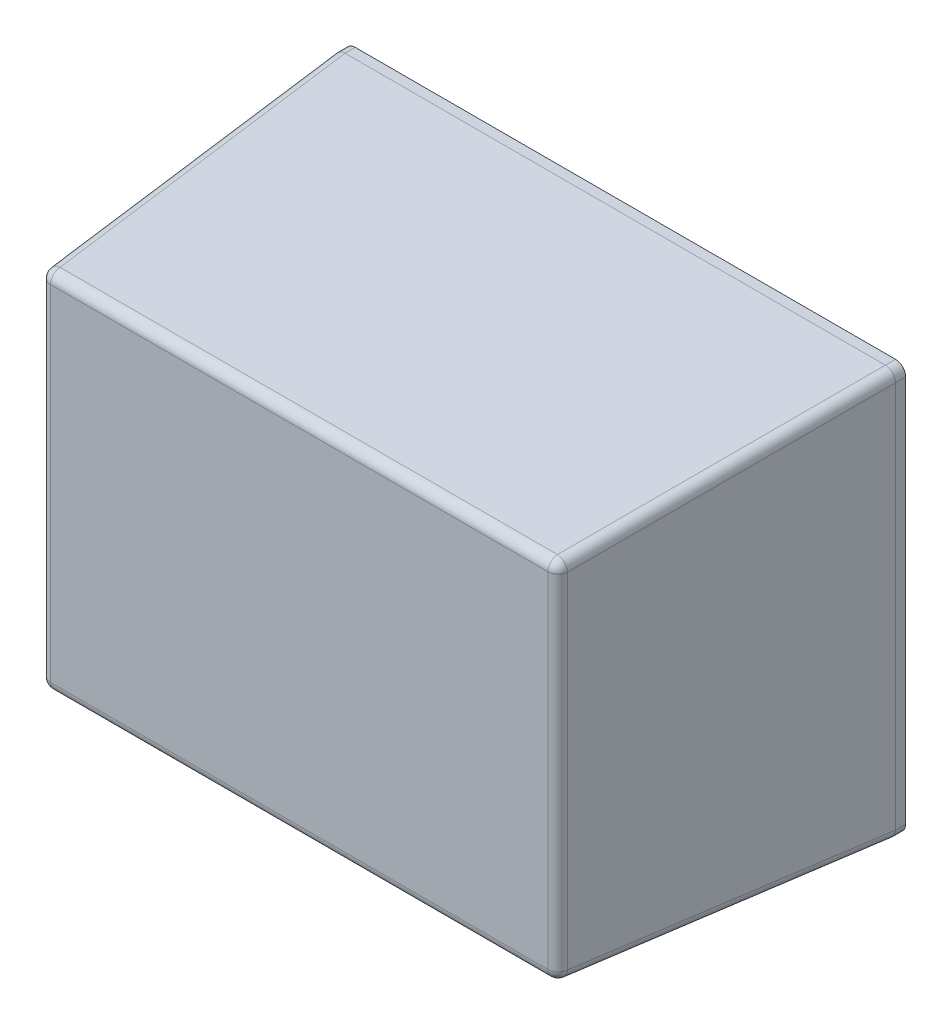
ISO-10303-21;
HEADER;
FILE_DESCRIPTION(('STEP AP214'),'2;1');
FILE_NAME('part.step','',(''),(''),'','','');
FILE_SCHEMA(('AUTOMOTIVE_DESIGN { 1 0 10303 214 1 1 1 1 }'));
ENDSEC;
DATA;
#1=APPLICATION_CONTEXT('core data for automotive mechanical design processes');
#2=APPLICATION_PROTOCOL_DEFINITION('international standard','automotive_design',2000,#1);
#3=PRODUCT_CONTEXT('',#1,'mechanical');
#4=PRODUCT('Part','Part','',(#3));
#5=PRODUCT_RELATED_PRODUCT_CATEGORY('part','',(#4));
#6=PRODUCT_DEFINITION_FORMATION('','',#4);
#7=PRODUCT_DEFINITION_CONTEXT('part definition',#1,'design');
#8=PRODUCT_DEFINITION('design','',#6,#7);
#9=PRODUCT_DEFINITION_SHAPE('','',#8);
#10=(LENGTH_UNIT() NAMED_UNIT(*) SI_UNIT(.MILLI.,.METRE.));
#11=(NAMED_UNIT(*) PLANE_ANGLE_UNIT() SI_UNIT($,.RADIAN.));
#12=(NAMED_UNIT(*) SI_UNIT($,.STERADIAN.) SOLID_ANGLE_UNIT());
#13=UNCERTAINTY_MEASURE_WITH_UNIT(LENGTH_MEASURE(1.E-05),#10,'distance_accuracy_value','');
#14=(GEOMETRIC_REPRESENTATION_CONTEXT(3) GLOBAL_UNCERTAINTY_ASSIGNED_CONTEXT((#13)) GLOBAL_UNIT_ASSIGNED_CONTEXT((#10,
#11,#12)) REPRESENTATION_CONTEXT('',''));
#15=CARTESIAN_POINT('',(0.,0.,0.));
#16=DIRECTION('',(0.,0.,1.));
#17=DIRECTION('',(1.,0.,0.));
#18=AXIS2_PLACEMENT_3D('',#15,#16,#17);
#19=CARTESIAN_POINT('',(-0.55,-0.380048718995,0.28));
#20=DIRECTION('',(-1.,0.,0.));
#21=DIRECTION('',(0.,0.,1.));
#22=AXIS2_PLACEMENT_3D('',#19,#20,#21);
#23=PLANE('',#22);
#24=DIRECTION('',(0.,-1.,0.));
#25=VECTOR('',#24,1.);
#26=CARTESIAN_POINT('',(-0.55,-0.347785001125,0.28));
#27=LINE('',#26,#25);
#28=CARTESIAN_POINT('',(-0.55,0.380048718995,0.28));
#29=VERTEX_POINT('',#28);
#30=CARTESIAN_POINT('',(-0.55,-0.380048718995,0.28));
#31=VERTEX_POINT('',#30);
#32=EDGE_CURVE('E41',#29,#31,#27,.T.);
#33=ORIENTED_EDGE('',*,*,#32,.F.);
#34=DIRECTION('',(0.,0.,-1.));
#35=VECTOR('',#34,1.);
#36=CARTESIAN_POINT('',(-0.55,0.380048718995,0.28));
#37=LINE('',#36,#35);
#38=CARTESIAN_POINT('',(-0.55,0.380048718995,0.26));
#39=VERTEX_POINT('',#38);
#40=EDGE_CURVE('E11',#29,#39,#37,.T.);
#41=ORIENTED_EDGE('',*,*,#40,.T.);
#42=DIRECTION('',(0.,1.,0.));
#43=VECTOR('',#42,1.);
#44=CARTESIAN_POINT('',(-0.55,0.380048718995,0.26));
#45=LINE('',#44,#43);
#46=CARTESIAN_POINT('',(-0.55,-0.380048718995,0.26));
#47=VERTEX_POINT('',#46);
#48=EDGE_CURVE('E262',#47,#39,#45,.T.);
#49=ORIENTED_EDGE('',*,*,#48,.F.);
#50=DIRECTION('',(0.,0.,-1.));
#51=VECTOR('',#50,1.);
#52=CARTESIAN_POINT('',(-0.55,-0.380048718995,0.28));
#53=LINE('',#52,#51);
#54=EDGE_CURVE('E216',#31,#47,#53,.T.);
#55=ORIENTED_EDGE('',*,*,#54,.F.);
#56=EDGE_LOOP('',(#33,#41,#49,#55));
#57=FACE_BOUND('',#56,.T.);
#58=ADVANCED_FACE('F17',(#57),#23,.T.);
#59=CARTESIAN_POINT('',(-0.530048718995,-0.4,0.28));
#60=CARTESIAN_POINT('',(-0.55,-0.4,0.28));
#61=CARTESIAN_POINT('',(-0.55,-0.380048718995,0.28));
#62=CARTESIAN_POINT('',(-0.530048718995,-0.4,0.26));
#63=CARTESIAN_POINT('',(-0.55,-0.4,0.26));
#64=CARTESIAN_POINT('',(-0.55,-0.380048718995,0.26));
#65=(BOUNDED_SURFACE() B_SPLINE_SURFACE(1,2,((#59,#60,#61),(#62,#63,#64)),.UNSPECIFIED.,.F.,.F.,
.F.) B_SPLINE_SURFACE_WITH_KNOTS((2,2),(3,3),(0.,0.995145815784),(2.358627482608,
3.924557824571),.UNSPECIFIED.) GEOMETRIC_REPRESENTATION_ITEM() RATIONAL_B_SPLINE_SURFACE(((1.,
0.708825072084,1.),(1.,0.708825072084,1.))) REPRESENTATION_ITEM('') SURFACE());
#66=CARTESIAN_POINT('',(-0.529951162038,-0.379951162038,0.28));
#67=DIRECTION('',(0.,0.,-1.));
#68=DIRECTION('',(-0.707106781186548,-0.707106781186548,0.));
#69=AXIS2_PLACEMENT_3D('',#66,#67,#68);
#70=ELLIPSE('',#69,0.02009755724517,0.02);
#71=CARTESIAN_POINT('',(-0.530048718995,-0.4,0.28));
#72=VERTEX_POINT('',#71);
#73=EDGE_CURVE('E28',#72,#31,#70,.T.);
#74=CARTESIAN_POINT('',(-0.529951162038,-0.379951162038,0.26));
#75=DIRECTION('',(0.,0.,-1.));
#76=DIRECTION('',(0.707106781186548,0.707106781186548,0.));
#77=AXIS2_PLACEMENT_3D('',#74,#75,#76);
#78=ELLIPSE('',#77,0.02009755724517,0.02);
#79=CARTESIAN_POINT('',(-0.530048718995,-0.4,0.26));
#80=VERTEX_POINT('',#79);
#81=EDGE_CURVE('E259',#80,#47,#78,.T.);
#82=DIRECTION('',(0.,0.,-1.));
#83=VECTOR('',#82,1.);
#84=CARTESIAN_POINT('',(-0.530048718995,-0.4,0.28));
#85=LINE('',#84,#83);
#86=EDGE_CURVE('E212',#72,#80,#85,.T.);
#87=ORIENTED_EDGE('',*,*,#73,.T.);
#88=ORIENTED_EDGE('',*,*,#54,.T.);
#89=ORIENTED_EDGE('',*,*,#81,.F.);
#90=ORIENTED_EDGE('',*,*,#86,.F.);
#91=EDGE_LOOP('',(#87,#88,#89,#90));
#92=FACE_BOUND('',#91,.T.);
#93=ADVANCED_FACE('F380',(#92),#65,.F.);
#94=CARTESIAN_POINT('',(0.530048718995,-0.4,0.28));
#95=DIRECTION('',(0.,-1.,0.));
#96=DIRECTION('',(0.,0.,-1.));
#97=AXIS2_PLACEMENT_3D('',#94,#95,#96);
#98=PLANE('',#97);
#99=DIRECTION('',(1.,0.,0.));
#100=VECTOR('',#99,1.);
#101=CARTESIAN_POINT('',(-0.4,-0.4,0.28));
#102=LINE('',#101,#100);
#103=CARTESIAN_POINT('',(0.530048718995,-0.4,0.28));
#104=VERTEX_POINT('',#103);
#105=EDGE_CURVE('E179',#72,#104,#102,.T.);
#106=ORIENTED_EDGE('',*,*,#105,.F.);
#107=ORIENTED_EDGE('',*,*,#86,.T.);
#108=DIRECTION('',(-1.,0.,0.));
#109=VECTOR('',#108,1.);
#110=CARTESIAN_POINT('',(-0.530048718995,-0.4,0.26));
#111=LINE('',#110,#109);
#112=CARTESIAN_POINT('',(0.530048718995,-0.4,0.26));
#113=VERTEX_POINT('',#112);
#114=EDGE_CURVE('E203',#113,#80,#111,.T.);
#115=ORIENTED_EDGE('',*,*,#114,.F.);
#116=DIRECTION('',(0.,0.,-1.));
#117=VECTOR('',#116,1.);
#118=CARTESIAN_POINT('',(0.530048718995,-0.4,0.28));
#119=LINE('',#118,#117);
#120=EDGE_CURVE('E300',#104,#113,#119,.T.);
#121=ORIENTED_EDGE('',*,*,#120,.F.);
#122=EDGE_LOOP('',(#106,#107,#115,#121));
#123=FACE_BOUND('',#122,.T.);
#124=ADVANCED_FACE('F385',(#123),#98,.T.);
#125=CARTESIAN_POINT('',(0.55,-0.380048718995,0.28));
#126=CARTESIAN_POINT('',(0.55,-0.4,0.28));
#127=CARTESIAN_POINT('',(0.530048718995,-0.4,0.28));
#128=CARTESIAN_POINT('',(0.55,-0.380048718995,0.26));
#129=CARTESIAN_POINT('',(0.55,-0.4,0.26));
#130=CARTESIAN_POINT('',(0.530048718995,-0.4,0.26));
#131=(BOUNDED_SURFACE() B_SPLINE_SURFACE(1,2,((#125,#126,#127),(#128,#129,#130)),.UNSPECIFIED.,
.F.,.F.,.F.) B_SPLINE_SURFACE_WITH_KNOTS((2,2),(3,3),(0.,0.995145815784),(2.358627482608,
3.924557824571),.UNSPECIFIED.) GEOMETRIC_REPRESENTATION_ITEM() RATIONAL_B_SPLINE_SURFACE(((1.,
0.708825072084,1.),(1.,0.708825072084,1.))) REPRESENTATION_ITEM('') SURFACE());
#132=CARTESIAN_POINT('',(0.529951162038,-0.379951162038,0.28));
#133=DIRECTION('',(0.,0.,-1.));
#134=DIRECTION('',(0.707106781186548,-0.707106781186548,0.));
#135=AXIS2_PLACEMENT_3D('',#132,#133,#134);
#136=ELLIPSE('',#135,0.02009755724517,0.02);
#137=CARTESIAN_POINT('',(0.55,-0.380048718995,0.28));
#138=VERTEX_POINT('',#137);
#139=EDGE_CURVE('E217',#138,#104,#136,.T.);
#140=CARTESIAN_POINT('',(0.529951162038,-0.379951162038,0.26));
#141=DIRECTION('',(0.,0.,-1.));
#142=DIRECTION('',(-0.707106781186548,0.707106781186548,0.));
#143=AXIS2_PLACEMENT_3D('',#140,#141,#142);
#144=ELLIPSE('',#143,0.02009755724517,0.02);
#145=CARTESIAN_POINT('',(0.55,-0.380048718995,0.26));
#146=VERTEX_POINT('',#145);
#147=EDGE_CURVE('E199',#146,#113,#144,.T.);
#148=DIRECTION('',(0.,0.,-1.));
#149=VECTOR('',#148,1.);
#150=CARTESIAN_POINT('',(0.55,-0.380048718995,0.28));
#151=LINE('',#150,#149);
#152=EDGE_CURVE('E437',#138,#146,#151,.T.);
#153=ORIENTED_EDGE('',*,*,#139,.T.);
#154=ORIENTED_EDGE('',*,*,#120,.T.);
#155=ORIENTED_EDGE('',*,*,#147,.F.);
#156=ORIENTED_EDGE('',*,*,#152,.F.);
#157=EDGE_LOOP('',(#153,#154,#155,#156));
#158=FACE_BOUND('',#157,.T.);
#159=ADVANCED_FACE('F410',(#158),#131,.F.);
#160=CARTESIAN_POINT('',(0.55,0.380048718995,0.28));
#161=DIRECTION('',(1.,0.,0.));
#162=DIRECTION('',(0.,1.,0.));
#163=AXIS2_PLACEMENT_3D('',#160,#161,#162);
#164=PLANE('',#163);
#165=DIRECTION('',(0.,1.,0.));
#166=VECTOR('',#165,1.);
#167=CARTESIAN_POINT('',(0.55,0.347785001125,0.28));
#168=LINE('',#167,#166);
#169=CARTESIAN_POINT('',(0.55,0.380048718995,0.28));
#170=VERTEX_POINT('',#169);
#171=EDGE_CURVE('E107',#138,#170,#168,.T.);
#172=ORIENTED_EDGE('',*,*,#171,.F.);
#173=ORIENTED_EDGE('',*,*,#152,.T.);
#174=DIRECTION('',(0.,-1.,0.));
#175=VECTOR('',#174,1.);
#176=CARTESIAN_POINT('',(0.55,-0.380048718995,0.26));
#177=LINE('',#176,#175);
#178=CARTESIAN_POINT('',(0.55,0.380048718995,0.26));
#179=VERTEX_POINT('',#178);
#180=EDGE_CURVE('E119',#179,#146,#177,.T.);
#181=ORIENTED_EDGE('',*,*,#180,.F.);
#182=DIRECTION('',(0.,0.,-1.));
#183=VECTOR('',#182,1.);
#184=CARTESIAN_POINT('',(0.55,0.380048718995,0.28));
#185=LINE('',#184,#183);
#186=EDGE_CURVE('E208',#170,#179,#185,.T.);
#187=ORIENTED_EDGE('',*,*,#186,.F.);
#188=EDGE_LOOP('',(#172,#173,#181,#187));
#189=FACE_BOUND('',#188,.T.);
#190=ADVANCED_FACE('F422',(#189),#164,.T.);
#191=CARTESIAN_POINT('',(0.530048718995,0.4,0.28));
#192=CARTESIAN_POINT('',(0.55,0.4,0.28));
#193=CARTESIAN_POINT('',(0.55,0.380048718995,0.28));
#194=CARTESIAN_POINT('',(0.530048718995,0.4,0.26));
#195=CARTESIAN_POINT('',(0.55,0.4,0.26));
#196=CARTESIAN_POINT('',(0.55,0.380048718995,0.26));
#197=(BOUNDED_SURFACE() B_SPLINE_SURFACE(1,2,((#191,#192,#193),(#194,#195,#196)),.UNSPECIFIED.,
.F.,.F.,.F.) B_SPLINE_SURFACE_WITH_KNOTS((2,2),(3,3),(0.,0.995145815784),(2.358627482608,
3.924557824571),.UNSPECIFIED.) GEOMETRIC_REPRESENTATION_ITEM() RATIONAL_B_SPLINE_SURFACE(((1.,
0.708825072084,1.),(1.,0.708825072084,1.))) REPRESENTATION_ITEM('') SURFACE());
#198=CARTESIAN_POINT('',(0.529951162038,0.379951162038,0.28));
#199=DIRECTION('',(0.,0.,-1.));
#200=DIRECTION('',(0.707106781186548,0.707106781186548,0.));
#201=AXIS2_PLACEMENT_3D('',#198,#199,#200);
#202=ELLIPSE('',#201,0.02009755724517,0.02);
#203=CARTESIAN_POINT('',(0.530048718995,0.4,0.28));
#204=VERTEX_POINT('',#203);
#205=EDGE_CURVE('E21',#204,#170,#202,.T.);
#206=CARTESIAN_POINT('',(0.529951162038,0.379951162038,0.26));
#207=DIRECTION('',(0.,0.,-1.));
#208=DIRECTION('',(-0.707106781186548,-0.707106781186548,0.));
#209=AXIS2_PLACEMENT_3D('',#206,#207,#208);
#210=ELLIPSE('',#209,0.02009755724517,0.02);
#211=CARTESIAN_POINT('',(0.530048718995,0.4,0.26));
#212=VERTEX_POINT('',#211);
#213=EDGE_CURVE('E283',#212,#179,#210,.T.);
#214=DIRECTION('',(0.,0.,-1.));
#215=VECTOR('',#214,1.);
#216=CARTESIAN_POINT('',(0.530048718995,0.4,0.28));
#217=LINE('',#216,#215);
#218=EDGE_CURVE('E211',#204,#212,#217,.T.);
#219=ORIENTED_EDGE('',*,*,#205,.T.);
#220=ORIENTED_EDGE('',*,*,#186,.T.);
#221=ORIENTED_EDGE('',*,*,#213,.F.);
#222=ORIENTED_EDGE('',*,*,#218,.F.);
#223=EDGE_LOOP('',(#219,#220,#221,#222));
#224=FACE_BOUND('',#223,.T.);
#225=ADVANCED_FACE('F432',(#224),#197,.F.);
#226=CARTESIAN_POINT('',(-0.530048718995,0.4,0.28));
#227=DIRECTION('',(0.,1.,0.));
#228=DIRECTION('',(1.,0.,0.));
#229=AXIS2_PLACEMENT_3D('',#226,#227,#228);
#230=PLANE('',#229);
#231=DIRECTION('',(-1.,0.,0.));
#232=VECTOR('',#231,1.);
#233=CARTESIAN_POINT('',(0.4,0.4,0.28));
#234=LINE('',#233,#232);
#235=CARTESIAN_POINT('',(-0.530048718995,0.4,0.28));
#236=VERTEX_POINT('',#235);
#237=EDGE_CURVE('E302',#204,#236,#234,.T.);
#238=ORIENTED_EDGE('',*,*,#237,.F.);
#239=ORIENTED_EDGE('',*,*,#218,.T.);
#240=DIRECTION('',(1.,0.,0.));
#241=VECTOR('',#240,1.);
#242=CARTESIAN_POINT('',(0.530048718995,0.4,0.26));
#243=LINE('',#242,#241);
#244=CARTESIAN_POINT('',(-0.530048718995,0.4,0.26));
#245=VERTEX_POINT('',#244);
#246=EDGE_CURVE('E449',#245,#212,#243,.T.);
#247=ORIENTED_EDGE('',*,*,#246,.F.);
#248=DIRECTION('',(0.,0.,-1.));
#249=VECTOR('',#248,1.);
#250=CARTESIAN_POINT('',(-0.530048718995,0.4,0.28));
#251=LINE('',#250,#249);
#252=EDGE_CURVE('E229',#236,#245,#251,.T.);
#253=ORIENTED_EDGE('',*,*,#252,.F.);
#254=EDGE_LOOP('',(#238,#239,#247,#253));
#255=FACE_BOUND('',#254,.T.);
#256=ADVANCED_FACE('F402',(#255),#230,.T.);
#257=CARTESIAN_POINT('',(-0.55,0.380048718995,0.28));
#258=CARTESIAN_POINT('',(-0.55,0.4,0.28));
#259=CARTESIAN_POINT('',(-0.530048718995,0.4,0.28));
#260=CARTESIAN_POINT('',(-0.55,0.380048718995,0.26));
#261=CARTESIAN_POINT('',(-0.55,0.4,0.26));
#262=CARTESIAN_POINT('',(-0.530048718995,0.4,0.26));
#263=(BOUNDED_SURFACE() B_SPLINE_SURFACE(1,2,((#257,#258,#259),(#260,#261,#262)),.UNSPECIFIED.,
.F.,.F.,.F.) B_SPLINE_SURFACE_WITH_KNOTS((2,2),(3,3),(0.,0.995145815784),(2.358627482608,
3.924557824571),.UNSPECIFIED.) GEOMETRIC_REPRESENTATION_ITEM() RATIONAL_B_SPLINE_SURFACE(((1.,
0.708825072084,1.),(1.,0.708825072084,1.))) REPRESENTATION_ITEM('') SURFACE());
#264=CARTESIAN_POINT('',(-0.529951162038,0.379951162038,0.28));
#265=DIRECTION('',(0.,0.,-1.));
#266=DIRECTION('',(-0.707106781186548,0.707106781186548,0.));
#267=AXIS2_PLACEMENT_3D('',#264,#265,#266);
#268=ELLIPSE('',#267,0.02009755724517,0.02);
#269=EDGE_CURVE('E232',#29,#236,#268,.T.);
#270=CARTESIAN_POINT('',(-0.529951162038,0.379951162038,0.26));
#271=DIRECTION('',(0.,0.,-1.));
#272=DIRECTION('',(0.707106781186548,-0.707106781186548,0.));
#273=AXIS2_PLACEMENT_3D('',#270,#271,#272);
#274=ELLIPSE('',#273,0.02009755724517,0.02);
#275=EDGE_CURVE('E233',#39,#245,#274,.T.);
#276=ORIENTED_EDGE('',*,*,#269,.T.);
#277=ORIENTED_EDGE('',*,*,#252,.T.);
#278=ORIENTED_EDGE('',*,*,#275,.F.);
#279=ORIENTED_EDGE('',*,*,#40,.F.);
#280=EDGE_LOOP('',(#276,#277,#278,#279));
#281=FACE_BOUND('',#280,.T.);
#282=ADVANCED_FACE('F396',(#281),#263,.F.);
#283=CARTESIAN_POINT('',(0.,0.,0.26));
#284=DIRECTION('',(0.,0.,1.));
#285=DIRECTION('',(1.,0.,0.));
#286=AXIS2_PLACEMENT_3D('',#283,#284,#285);
#287=PLANE('',#286);
#288=ORIENTED_EDGE('',*,*,#275,.T.);
#289=ORIENTED_EDGE('',*,*,#246,.T.);
#290=ORIENTED_EDGE('',*,*,#213,.T.);
#291=ORIENTED_EDGE('',*,*,#180,.T.);
#292=ORIENTED_EDGE('',*,*,#147,.T.);
#293=ORIENTED_EDGE('',*,*,#114,.T.);
#294=ORIENTED_EDGE('',*,*,#81,.T.);
#295=ORIENTED_EDGE('',*,*,#48,.T.);
#296=EDGE_LOOP('',(#288,#289,#290,#291,#292,#293,#294,#295));
#297=FACE_BOUND('',#296,.T.);
#298=ADVANCED_FACE('F401',(#297),#287,.F.);
#299=CARTESIAN_POINT('',(-0.2,-0.337995074872,0.88));
#300=DIRECTION('',(-1.,0.,0.));
#301=DIRECTION('',(0.,-0.681998360062852,0.731353701618841));
#302=AXIS2_PLACEMENT_3D('',#299,#300,#301);
#303=CYLINDRICAL_SURFACE('',#302,0.02);
#304=CARTESIAN_POINT('',(0.487995074872,-0.337995074872,0.88));
#305=DIRECTION('',(-1.,0.,0.));
#306=DIRECTION('',(0.,-0.997564050259826,0.0697564737441078));
#307=AXIS2_PLACEMENT_3D('',#304,#305,#306);
#308=CIRCLE('',#307,0.02);
#309=CARTESIAN_POINT('',(0.487995074872,-0.357946355877,0.881395129475));
#310=VERTEX_POINT('',#309);
#311=CARTESIAN_POINT('',(0.487995074872,-0.337995074872,0.9));
#312=VERTEX_POINT('',#311);
#313=EDGE_CURVE('E268',#310,#312,#308,.T.);
#314=ORIENTED_EDGE('',*,*,#313,.T.);
#315=DIRECTION('',(-1.,0.,0.));
#316=VECTOR('',#315,1.);
#317=CARTESIAN_POINT('',(-0.2,-0.337995074872,0.9));
#318=LINE('',#317,#316);
#319=CARTESIAN_POINT('',(-0.487995074872,-0.337995074872,0.9));
#320=VERTEX_POINT('',#319);
#321=EDGE_CURVE('E170',#312,#320,#318,.T.);
#322=ORIENTED_EDGE('',*,*,#321,.T.);
#323=CARTESIAN_POINT('',(-0.487995074872,-0.337995074872,0.88));
#324=DIRECTION('',(1.,0.,0.));
#325=DIRECTION('',(0.,0.,1.));
#326=AXIS2_PLACEMENT_3D('',#323,#324,#325);
#327=CIRCLE('',#326,0.02);
#328=CARTESIAN_POINT('',(-0.487995074872,-0.357946355877,0.881395129475));
#329=VERTEX_POINT('',#328);
#330=EDGE_CURVE('E142',#320,#329,#327,.T.);
#331=ORIENTED_EDGE('',*,*,#330,.T.);
#332=DIRECTION('',(1.,0.,0.));
#333=VECTOR('',#332,1.);
#334=CARTESIAN_POINT('',(-0.2,-0.357946355877,0.881395129475));
#335=LINE('',#334,#333);
#336=EDGE_CURVE('E158',#329,#310,#335,.T.);
#337=ORIENTED_EDGE('',*,*,#336,.T.);
#338=EDGE_LOOP('',(#314,#322,#331,#337));
#339=FACE_BOUND('',#338,.T.);
#340=ADVANCED_FACE('F168',(#339),#303,.T.);
#341=CARTESIAN_POINT('',(-0.487995074872,-0.173892500563,0.88));
#342=DIRECTION('',(0.,1.,0.));
#343=DIRECTION('',(-0.681998360062852,0.,0.731353701618841));
#344=AXIS2_PLACEMENT_3D('',#341,#342,#343);
#345=CYLINDRICAL_SURFACE('',#344,0.02);
#346=CARTESIAN_POINT('',(-0.487995074872,-0.337995074872,0.88));
#347=DIRECTION('',(0.,1.,0.));
#348=DIRECTION('',(-0.997564050259826,0.,0.0697564737441078));
#349=AXIS2_PLACEMENT_3D('',#346,#347,#348);
#350=CIRCLE('',#349,0.02);
#351=CARTESIAN_POINT('',(-0.507946355877,-0.337995074872,0.881395129475));
#352=VERTEX_POINT('',#351);
#353=EDGE_CURVE('E144',#352,#320,#350,.T.);
#354=ORIENTED_EDGE('',*,*,#353,.T.);
#355=DIRECTION('',(0.,1.,0.));
#356=VECTOR('',#355,1.);
#357=CARTESIAN_POINT('',(-0.487995074872,-0.173892500563,0.9));
#358=LINE('',#357,#356);
#359=CARTESIAN_POINT('',(-0.487995074872,0.337995074872,0.9));
#360=VERTEX_POINT('',#359);
#361=EDGE_CURVE('E307',#320,#360,#358,.T.);
#362=ORIENTED_EDGE('',*,*,#361,.T.);
#363=CARTESIAN_POINT('',(-0.487995074872,0.337995074872,0.88));
#364=DIRECTION('',(0.,-1.,0.));
#365=DIRECTION('',(0.,0.,1.));
#366=AXIS2_PLACEMENT_3D('',#363,#364,#365);
#367=CIRCLE('',#366,0.02);
#368=CARTESIAN_POINT('',(-0.507946355877,0.337995074872,0.881395129475));
#369=VERTEX_POINT('',#368);
#370=EDGE_CURVE('E266',#360,#369,#367,.T.);
#371=ORIENTED_EDGE('',*,*,#370,.T.);
#372=DIRECTION('',(0.,-1.,0.));
#373=VECTOR('',#372,1.);
#374=CARTESIAN_POINT('',(-0.507946355877,-0.173892500563,0.881395129475));
#375=LINE('',#374,#373);
#376=EDGE_CURVE('E151',#369,#352,#375,.T.);
#377=ORIENTED_EDGE('',*,*,#376,.T.);
#378=EDGE_LOOP('',(#354,#362,#371,#377));
#379=FACE_BOUND('',#378,.T.);
#380=ADVANCED_FACE('F19',(#379),#345,.T.);
#381=CARTESIAN_POINT('',(-0.487995074872,-0.337995074872,0.88));
#382=DIRECTION('',(0.362330205201988,-0.835112809389974,-0.413888170875987));
#383=DIRECTION('',(-0.550078717633075,-0.550078717633075,0.628352455883085));
#384=AXIS2_PLACEMENT_3D('',#381,#382,#383);
#385=SPHERICAL_SURFACE('',#384,0.02);
#386=ORIENTED_EDGE('',*,*,#353,.F.);
#387=CARTESIAN_POINT('',(-0.487995074872,-0.337995074872,0.88));
#388=DIRECTION('',(0.0695873743166583,0.0695873743166583,0.99514581578351));
#389=DIRECTION('',(-0.703674354609938,-0.703674354609938,0.0984114085285514));
#390=AXIS2_PLACEMENT_3D('',#387,#388,#389);
#391=CIRCLE('',#390,0.02);
#392=EDGE_CURVE('E138',#352,#329,#391,.T.);
#393=ORIENTED_EDGE('',*,*,#392,.T.);
#394=ORIENTED_EDGE('',*,*,#330,.F.);
#395=EDGE_LOOP('',(#386,#393,#394));
#396=FACE_BOUND('',#395,.T.);
#397=ADVANCED_FACE('F140',(#396),#385,.T.);
#398=CARTESIAN_POINT('',(0.2,0.337995074872,0.88));
#399=DIRECTION('',(1.,0.,0.));
#400=DIRECTION('',(0.,0.681998360062852,0.731353701618841));
#401=AXIS2_PLACEMENT_3D('',#398,#399,#400);
#402=CYLINDRICAL_SURFACE('',#401,0.02);
#403=CARTESIAN_POINT('',(-0.487995074872,0.337995074872,0.88));
#404=DIRECTION('',(1.,0.,0.));
#405=DIRECTION('',(0.,0.997564050259826,0.0697564737441078));
#406=AXIS2_PLACEMENT_3D('',#403,#404,#405);
#407=CIRCLE('',#406,0.02);
#408=CARTESIAN_POINT('',(-0.487995074872,0.357946355877,0.881395129475));
#409=VERTEX_POINT('',#408);
#410=EDGE_CURVE('E152',#409,#360,#407,.T.);
#411=ORIENTED_EDGE('',*,*,#410,.T.);
#412=DIRECTION('',(1.,0.,0.));
#413=VECTOR('',#412,1.);
#414=CARTESIAN_POINT('',(0.2,0.337995074872,0.9));
#415=LINE('',#414,#413);
#416=CARTESIAN_POINT('',(0.487995074872,0.337995074872,0.9));
#417=VERTEX_POINT('',#416);
#418=EDGE_CURVE('E207',#360,#417,#415,.T.);
#419=ORIENTED_EDGE('',*,*,#418,.T.);
#420=CARTESIAN_POINT('',(0.487995074872,0.337995074872,0.88));
#421=DIRECTION('',(-1.,0.,0.));
#422=DIRECTION('',(0.,0.,1.));
#423=AXIS2_PLACEMENT_3D('',#420,#421,#422);
#424=CIRCLE('',#423,0.02);
#425=CARTESIAN_POINT('',(0.487995074872,0.357946355877,0.881395129475));
#426=VERTEX_POINT('',#425);
#427=EDGE_CURVE('E197',#417,#426,#424,.T.);
#428=ORIENTED_EDGE('',*,*,#427,.T.);
#429=DIRECTION('',(-1.,0.,0.));
#430=VECTOR('',#429,1.);
#431=CARTESIAN_POINT('',(0.2,0.357946355877,0.881395129475));
#432=LINE('',#431,#430);
#433=EDGE_CURVE('E193',#426,#409,#432,.T.);
#434=ORIENTED_EDGE('',*,*,#433,.T.);
#435=EDGE_LOOP('',(#411,#419,#428,#434));
#436=FACE_BOUND('',#435,.T.);
#437=ADVANCED_FACE('F417',(#436),#402,.T.);
#438=CARTESIAN_POINT('',(-0.487995074872,0.337995074872,0.88));
#439=DIRECTION('',(-0.362330205201988,-0.835112809389974,0.413888170875987));
#440=DIRECTION('',(-0.550078717633075,0.550078717633075,0.628352455883085));
#441=AXIS2_PLACEMENT_3D('',#438,#439,#440);
#442=SPHERICAL_SURFACE('',#441,0.02);
#443=ORIENTED_EDGE('',*,*,#410,.F.);
#444=CARTESIAN_POINT('',(-0.487995074872,0.337995074872,0.88));
#445=DIRECTION('',(0.0695873743166583,-0.0695873743166583,0.99514581578351));
#446=DIRECTION('',(-0.703674354609938,0.703674354609938,0.0984114085285514));
#447=AXIS2_PLACEMENT_3D('',#444,#445,#446);
#448=CIRCLE('',#447,0.02);
#449=EDGE_CURVE('E198',#409,#369,#448,.T.);
#450=ORIENTED_EDGE('',*,*,#449,.T.);
#451=ORIENTED_EDGE('',*,*,#370,.F.);
#452=EDGE_LOOP('',(#443,#450,#451));
#453=FACE_BOUND('',#452,.T.);
#454=ADVANCED_FACE('F326',(#453),#442,.T.);
#455=CARTESIAN_POINT('',(0.487995074872,0.173892500563,0.88));
#456=DIRECTION('',(0.,-1.,0.));
#457=DIRECTION('',(0.681998360062852,0.,0.731353701618841));
#458=AXIS2_PLACEMENT_3D('',#455,#456,#457);
#459=CYLINDRICAL_SURFACE('',#458,0.02);
#460=CARTESIAN_POINT('',(0.487995074872,0.337995074872,0.88));
#461=DIRECTION('',(0.,-1.,0.));
#462=DIRECTION('',(0.997564050259826,0.,0.0697564737441078));
#463=AXIS2_PLACEMENT_3D('',#460,#461,#462);
#464=CIRCLE('',#463,0.02);
#465=CARTESIAN_POINT('',(0.507946355877,0.337995074872,0.881395129475));
#466=VERTEX_POINT('',#465);
#467=EDGE_CURVE('E254',#466,#417,#464,.T.);
#468=ORIENTED_EDGE('',*,*,#467,.T.);
#469=DIRECTION('',(0.,-1.,0.));
#470=VECTOR('',#469,1.);
#471=CARTESIAN_POINT('',(0.487995074872,0.173892500563,0.9));
#472=LINE('',#471,#470);
#473=EDGE_CURVE('E258',#417,#312,#472,.T.);
#474=ORIENTED_EDGE('',*,*,#473,.T.);
#475=CARTESIAN_POINT('',(0.487995074872,-0.337995074872,0.88));
#476=DIRECTION('',(0.,1.,0.));
#477=DIRECTION('',(0.,0.,1.));
#478=AXIS2_PLACEMENT_3D('',#475,#476,#477);
#479=CIRCLE('',#478,0.02);
#480=CARTESIAN_POINT('',(0.507946355877,-0.337995074872,0.881395129475));
#481=VERTEX_POINT('',#480);
#482=EDGE_CURVE('E270',#312,#481,#479,.T.);
#483=ORIENTED_EDGE('',*,*,#482,.T.);
#484=DIRECTION('',(0.,1.,0.));
#485=VECTOR('',#484,1.);
#486=CARTESIAN_POINT('',(0.507946355877,0.173892500563,0.881395129475));
#487=LINE('',#486,#485);
#488=EDGE_CURVE('E274',#481,#466,#487,.T.);
#489=ORIENTED_EDGE('',*,*,#488,.T.);
#490=EDGE_LOOP('',(#468,#474,#483,#489));
#491=FACE_BOUND('',#490,.T.);
#492=ADVANCED_FACE('F357',(#491),#459,.T.);
#493=CARTESIAN_POINT('',(0.487995074872,0.337995074872,0.88));
#494=DIRECTION('',(0.362330205201988,-0.835112809389974,0.413888170875987));
#495=DIRECTION('',(0.550078717633075,0.550078717633075,0.628352455883085));
#496=AXIS2_PLACEMENT_3D('',#493,#494,#495);
#497=SPHERICAL_SURFACE('',#496,0.02);
#498=ORIENTED_EDGE('',*,*,#467,.F.);
#499=CARTESIAN_POINT('',(0.487995074872,0.337995074872,0.88));
#500=DIRECTION('',(-0.0695873743166583,-0.0695873743166583,0.99514581578351));
#501=DIRECTION('',(0.703674354609938,0.703674354609938,0.0984114085285514));
#502=AXIS2_PLACEMENT_3D('',#499,#500,#501);
#503=CIRCLE('',#502,0.02);
#504=EDGE_CURVE('E278',#466,#426,#503,.T.);
#505=ORIENTED_EDGE('',*,*,#504,.T.);
#506=ORIENTED_EDGE('',*,*,#427,.F.);
#507=EDGE_LOOP('',(#498,#505,#506));
#508=FACE_BOUND('',#507,.T.);
#509=ADVANCED_FACE('F367',(#508),#497,.T.);
#510=CARTESIAN_POINT('',(0.487995074872,-0.337995074872,0.88));
#511=DIRECTION('',(-0.362330205201988,-0.835112809389974,-0.413888170875987));
#512=DIRECTION('',(0.550078717633075,-0.550078717633075,0.628352455883085));
#513=AXIS2_PLACEMENT_3D('',#510,#511,#512);
#514=SPHERICAL_SURFACE('',#513,0.02);
#515=ORIENTED_EDGE('',*,*,#313,.F.);
#516=CARTESIAN_POINT('',(0.487995074872,-0.337995074872,0.88));
#517=DIRECTION('',(-0.0695873743166583,0.0695873743166583,0.99514581578351));
#518=DIRECTION('',(0.703674354609938,-0.703674354609938,0.0984114085285514));
#519=AXIS2_PLACEMENT_3D('',#516,#517,#518);
#520=CIRCLE('',#519,0.02);
#521=EDGE_CURVE('E222',#310,#481,#520,.T.);
#522=ORIENTED_EDGE('',*,*,#521,.T.);
#523=ORIENTED_EDGE('',*,*,#482,.F.);
#524=EDGE_LOOP('',(#515,#522,#523));
#525=FACE_BOUND('',#524,.T.);
#526=ADVANCED_FACE('F365',(#525),#514,.T.);
#527=CARTESIAN_POINT('',(-0.504462310394,0.354462310394,0.644507560631));
#528=DIRECTION('',(-0.0695873743166583,0.0695873743166583,-0.99514581578351));
#529=DIRECTION('',(-0.703674354609938,0.703674354609938,0.0984114085285513));
#530=AXIS2_PLACEMENT_3D('',#527,#528,#529);
#531=CYLINDRICAL_SURFACE('',#530,0.02);
#532=ORIENTED_EDGE('',*,*,#449,.F.);
#533=DIRECTION('',(-0.069587374316626,0.069587374316626,-0.995145815783514));
#534=VECTOR('',#533,1.);
#535=CARTESIAN_POINT('',(-0.504462310394,0.374413591399,0.645902690106));
#536=LINE('',#535,#534);
#537=EDGE_CURVE('E218',#409,#236,#536,.T.);
#538=ORIENTED_EDGE('',*,*,#537,.T.);
#539=ORIENTED_EDGE('',*,*,#269,.F.);
#540=DIRECTION('',(0.069587374316626,-0.069587374316626,0.995145815783514));
#541=VECTOR('',#540,1.);
#542=CARTESIAN_POINT('',(-0.524413591399,0.354462310394,0.645902690106));
#543=LINE('',#542,#541);
#544=EDGE_CURVE('E223',#29,#369,#543,.T.);
#545=ORIENTED_EDGE('',*,*,#544,.T.);
#546=EDGE_LOOP('',(#532,#538,#539,#545));
#547=FACE_BOUND('',#546,.T.);
#548=ADVANCED_FACE('F314',(#547),#531,.T.);
#549=CARTESIAN_POINT('',(0.4,0.378322688298,0.59));
#550=DIRECTION('',(0.,0.997564050259825,0.0697564737441177));
#551=DIRECTION('',(1.,0.,0.));
#552=AXIS2_PLACEMENT_3D('',#549,#550,#551);
#553=PLANE('',#552);
#554=ORIENTED_EDGE('',*,*,#433,.F.);
#555=DIRECTION('',(-0.069587374316626,-0.069587374316626,0.995145815783514));
#556=VECTOR('',#555,1.);
#557=CARTESIAN_POINT('',(0.508083386476,0.378034667481,0.594118889571));
#558=LINE('',#557,#556);
#559=EDGE_CURVE('E189',#204,#426,#558,.T.);
#560=ORIENTED_EDGE('',*,*,#559,.F.);
#561=ORIENTED_EDGE('',*,*,#237,.T.);
#562=ORIENTED_EDGE('',*,*,#537,.F.);
#563=EDGE_LOOP('',(#554,#560,#561,#562));
#564=FACE_BOUND('',#563,.T.);
#565=ADVANCED_FACE('F374',(#564),#553,.T.);
#566=CARTESIAN_POINT('',(0.508083386476,0.358083386476,0.592723760096));
#567=DIRECTION('',(0.0695873743166583,0.0695873743166583,-0.99514581578351));
#568=DIRECTION('',(0.703674354609938,0.703674354609938,0.0984114085285513));
#569=AXIS2_PLACEMENT_3D('',#566,#567,#568);
#570=CYLINDRICAL_SURFACE('',#569,0.02);
#571=ORIENTED_EDGE('',*,*,#504,.F.);
#572=DIRECTION('',(0.069587374316626,0.069587374316626,-0.995145815783514));
#573=VECTOR('',#572,1.);
#574=CARTESIAN_POINT('',(0.528034667481,0.358083386476,0.594118889571));
#575=LINE('',#574,#573);
#576=EDGE_CURVE('E192',#466,#170,#575,.T.);
#577=ORIENTED_EDGE('',*,*,#576,.T.);
#578=ORIENTED_EDGE('',*,*,#205,.F.);
#579=ORIENTED_EDGE('',*,*,#559,.T.);
#580=EDGE_LOOP('',(#571,#577,#578,#579));
#581=FACE_BOUND('',#580,.T.);
#582=ADVANCED_FACE('F390',(#581),#570,.T.);
#583=CARTESIAN_POINT('',(0.528322688298,0.347785001125,0.59));
#584=DIRECTION('',(0.997564050259825,0.,0.0697564737441177));
#585=DIRECTION('',(0.,-1.,0.));
#586=AXIS2_PLACEMENT_3D('',#583,#584,#585);
#587=PLANE('',#586);
#588=ORIENTED_EDGE('',*,*,#488,.F.);
#589=DIRECTION('',(-0.069587374316626,0.069587374316626,0.995145815783514));
#590=VECTOR('',#589,1.);
#591=CARTESIAN_POINT('',(0.524413591399,-0.354462310394,0.645902690106));
#592=LINE('',#591,#590);
#593=EDGE_CURVE('E235',#138,#481,#592,.T.);
#594=ORIENTED_EDGE('',*,*,#593,.F.);
#595=ORIENTED_EDGE('',*,*,#171,.T.);
#596=ORIENTED_EDGE('',*,*,#576,.F.);
#597=EDGE_LOOP('',(#588,#594,#595,#596));
#598=FACE_BOUND('',#597,.T.);
#599=ADVANCED_FACE('F395',(#598),#587,.T.);
#600=CARTESIAN_POINT('',(0.,0.,0.9));
#601=DIRECTION('',(0.,0.,1.));
#602=DIRECTION('',(1.,0.,0.));
#603=AXIS2_PLACEMENT_3D('',#600,#601,#602);
#604=PLANE('',#603);
#605=ORIENTED_EDGE('',*,*,#321,.F.);
#606=ORIENTED_EDGE('',*,*,#473,.F.);
#607=ORIENTED_EDGE('',*,*,#418,.F.);
#608=ORIENTED_EDGE('',*,*,#361,.F.);
#609=EDGE_LOOP('',(#605,#606,#607,#608));
#610=FACE_BOUND('',#609,.T.);
#611=ADVANCED_FACE('F361',(#610),#604,.T.);
#612=CARTESIAN_POINT('',(0.504462310394,-0.354462310394,0.644507560631));
#613=DIRECTION('',(-0.0695873743166583,0.0695873743166583,0.99514581578351));
#614=DIRECTION('',(0.703674354609938,-0.703674354609938,0.0984114085285513));
#615=AXIS2_PLACEMENT_3D('',#612,#613,#614);
#616=CYLINDRICAL_SURFACE('',#615,0.02);
#617=ORIENTED_EDGE('',*,*,#521,.F.);
#618=DIRECTION('',(0.069587374316626,-0.069587374316626,-0.995145815783514));
#619=VECTOR('',#618,1.);
#620=CARTESIAN_POINT('',(0.504462310394,-0.374413591399,0.645902690106));
#621=LINE('',#620,#619);
#622=EDGE_CURVE('E162',#310,#104,#621,.T.);
#623=ORIENTED_EDGE('',*,*,#622,.T.);
#624=ORIENTED_EDGE('',*,*,#139,.F.);
#625=ORIENTED_EDGE('',*,*,#593,.T.);
#626=EDGE_LOOP('',(#617,#623,#624,#625));
#627=FACE_BOUND('',#626,.T.);
#628=ADVANCED_FACE('F394',(#627),#616,.T.);
#629=CARTESIAN_POINT('',(-0.528322688298,-0.347785001125,0.59));
#630=DIRECTION('',(-0.997564050259825,0.,0.0697564737441177));
#631=DIRECTION('',(0.,1.,0.));
#632=AXIS2_PLACEMENT_3D('',#629,#630,#631);
#633=PLANE('',#632);
#634=ORIENTED_EDGE('',*,*,#376,.F.);
#635=ORIENTED_EDGE('',*,*,#544,.F.);
#636=ORIENTED_EDGE('',*,*,#32,.T.);
#637=DIRECTION('',(-0.069587374316626,-0.069587374316626,-0.995145815783514));
#638=VECTOR('',#637,1.);
#639=CARTESIAN_POINT('',(-0.528034667481,-0.358083386476,0.594118889571));
#640=LINE('',#639,#638);
#641=EDGE_CURVE('E178',#352,#31,#640,.T.);
#642=ORIENTED_EDGE('',*,*,#641,.F.);
#643=EDGE_LOOP('',(#634,#635,#636,#642));
#644=FACE_BOUND('',#643,.T.);
#645=ADVANCED_FACE('F319',(#644),#633,.T.);
#646=CARTESIAN_POINT('',(-0.508083386476,-0.358083386476,0.592723760096));
#647=DIRECTION('',(0.0695873743166583,0.0695873743166583,0.99514581578351));
#648=DIRECTION('',(-0.703674354609938,-0.703674354609938,0.0984114085285513));
#649=AXIS2_PLACEMENT_3D('',#646,#647,#648);
#650=CYLINDRICAL_SURFACE('',#649,0.02);
#651=ORIENTED_EDGE('',*,*,#392,.F.);
#652=ORIENTED_EDGE('',*,*,#641,.T.);
#653=ORIENTED_EDGE('',*,*,#73,.F.);
#654=DIRECTION('',(0.069587374316626,0.069587374316626,0.995145815783514));
#655=VECTOR('',#654,1.);
#656=CARTESIAN_POINT('',(-0.508083386476,-0.378034667481,0.594118889571));
#657=LINE('',#656,#655);
#658=EDGE_CURVE('E160',#72,#329,#657,.T.);
#659=ORIENTED_EDGE('',*,*,#658,.T.);
#660=EDGE_LOOP('',(#651,#652,#653,#659));
#661=FACE_BOUND('',#660,.T.);
#662=ADVANCED_FACE('F175',(#661),#650,.T.);
#663=CARTESIAN_POINT('',(-0.4,-0.378322688298,0.59));
#664=DIRECTION('',(0.,-0.997564050259825,0.0697564737441177));
#665=DIRECTION('',(-1.,0.,0.));
#666=AXIS2_PLACEMENT_3D('',#663,#664,#665);
#667=PLANE('',#666);
#668=ORIENTED_EDGE('',*,*,#336,.F.);
#669=ORIENTED_EDGE('',*,*,#658,.F.);
#670=ORIENTED_EDGE('',*,*,#105,.T.);
#671=ORIENTED_EDGE('',*,*,#622,.F.);
#672=EDGE_LOOP('',(#668,#669,#670,#671));
#673=FACE_BOUND('',#672,.T.);
#674=ADVANCED_FACE('F159',(#673),#667,.T.);
#675=CLOSED_SHELL('',(#58,#93,#124,#159,#190,#225,#256,#282,#298,#340,#380,#397,#437,#454,#492,
#509,#526,#548,#565,#582,#599,#611,#628,#645,#662,#674));
#676=MANIFOLD_SOLID_BREP('B1',#675);
#677=ADVANCED_BREP_SHAPE_REPRESENTATION('',(#18,#676),#14);
#678=SHAPE_DEFINITION_REPRESENTATION(#9,#677);
ENDSEC;
END-ISO-10303-21;
